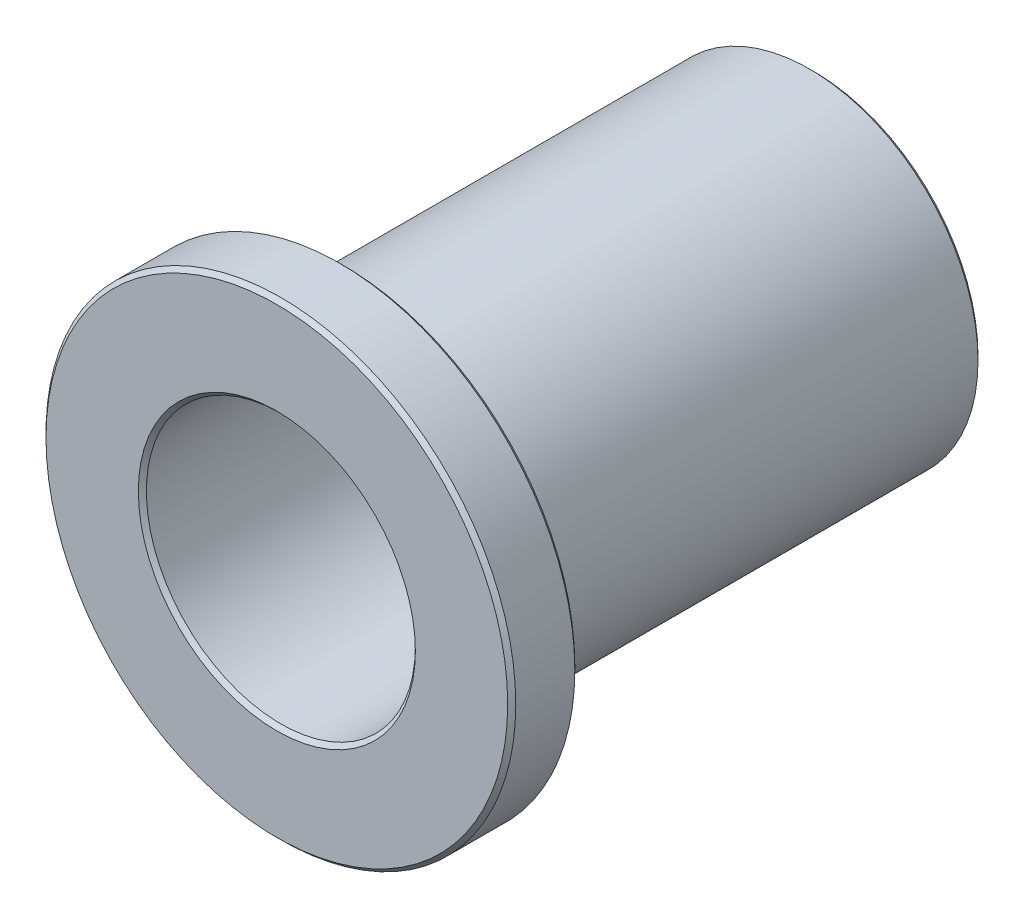
ISO-10303-21;
HEADER;
FILE_DESCRIPTION(('STEP AP214'),'2;1');
FILE_NAME('part.step','',(''),(''),'','','');
FILE_SCHEMA(('AUTOMOTIVE_DESIGN { 1 0 10303 214 1 1 1 1 }'));
ENDSEC;
DATA;
#1=APPLICATION_CONTEXT('core data for automotive mechanical design processes');
#2=APPLICATION_PROTOCOL_DEFINITION('international standard','automotive_design',2000,#1);
#3=PRODUCT_CONTEXT('',#1,'mechanical');
#4=PRODUCT('Part','Part','',(#3));
#5=PRODUCT_RELATED_PRODUCT_CATEGORY('part','',(#4));
#6=PRODUCT_DEFINITION_FORMATION('','',#4);
#7=PRODUCT_DEFINITION_CONTEXT('part definition',#1,'design');
#8=PRODUCT_DEFINITION('design','',#6,#7);
#9=PRODUCT_DEFINITION_SHAPE('','',#8);
#10=(LENGTH_UNIT() NAMED_UNIT(*) SI_UNIT(.MILLI.,.METRE.));
#11=(NAMED_UNIT(*) PLANE_ANGLE_UNIT() SI_UNIT($,.RADIAN.));
#12=(NAMED_UNIT(*) SI_UNIT($,.STERADIAN.) SOLID_ANGLE_UNIT());
#13=UNCERTAINTY_MEASURE_WITH_UNIT(LENGTH_MEASURE(1.E-05),#10,'distance_accuracy_value','');
#14=(GEOMETRIC_REPRESENTATION_CONTEXT(3) GLOBAL_UNCERTAINTY_ASSIGNED_CONTEXT((#13)) GLOBAL_UNIT_ASSIGNED_CONTEXT((#10,
#11,#12)) REPRESENTATION_CONTEXT('',''));
#15=CARTESIAN_POINT('',(0.,0.,0.));
#16=DIRECTION('',(0.,0.,1.));
#17=DIRECTION('',(1.,0.,0.));
#18=AXIS2_PLACEMENT_3D('',#15,#16,#17);
#19=CARTESIAN_POINT('',(0.,0.,9.525));
#20=DIRECTION('',(0.,0.,1.));
#21=DIRECTION('',(1.,0.,0.));
#22=AXIS2_PLACEMENT_3D('',#19,#20,#21);
#23=CYLINDRICAL_SURFACE('',#22,11.1125);
#24=CARTESIAN_POINT('',(0.,0.,12.509119));
#25=DIRECTION('',(0.,0.,1.));
#26=DIRECTION('',(1.,0.,0.));
#27=AXIS2_PLACEMENT_3D('',#24,#25,#26);
#28=CIRCLE('',#27,11.1125);
#29=CARTESIAN_POINT('',(11.1125,0.,12.509119));
#30=VERTEX_POINT('',#29);
#31=EDGE_CURVE('E69',#30,#30,#28,.F.);
#32=ORIENTED_EDGE('',*,*,#31,.T.);
#33=EDGE_LOOP('',(#32));
#34=FACE_BOUND('',#33,.T.);
#35=CARTESIAN_POINT('',(0.,0.,9.71588100000001));
#36=DIRECTION('',(0.,0.,1.));
#37=DIRECTION('',(1.,0.,0.));
#38=AXIS2_PLACEMENT_3D('',#35,#36,#37);
#39=CIRCLE('',#38,11.1125);
#40=CARTESIAN_POINT('',(11.1125,0.,9.71588100000001));
#41=VERTEX_POINT('',#40);
#42=EDGE_CURVE('E72',#41,#41,#39,.T.);
#43=ORIENTED_EDGE('',*,*,#42,.T.);
#44=EDGE_LOOP('',(#43));
#45=FACE_BOUND('',#44,.T.);
#46=ADVANCED_FACE('F41',(#34,#45),#23,.T.);
#47=CARTESIAN_POINT('',(0.,0.,9.525));
#48=DIRECTION('',(0.,0.,1.));
#49=DIRECTION('',(1.,0.,0.));
#50=AXIS2_PLACEMENT_3D('',#47,#48,#49);
#51=PLANE('',#50);
#52=CARTESIAN_POINT('',(0.,0.,9.525));
#53=DIRECTION('',(0.,0.,1.));
#54=DIRECTION('',(1.,0.,0.));
#55=AXIS2_PLACEMENT_3D('',#52,#53,#54);
#56=CIRCLE('',#55,10.921619);
#57=CARTESIAN_POINT('',(10.921619,0.,9.525));
#58=VERTEX_POINT('',#57);
#59=EDGE_CURVE('E63',#58,#58,#56,.F.);
#60=ORIENTED_EDGE('',*,*,#59,.T.);
#61=EDGE_LOOP('',(#60));
#62=FACE_BOUND('',#61,.T.);
#63=CARTESIAN_POINT('',(0.,0.,9.525));
#64=DIRECTION('',(0.,0.,1.));
#65=DIRECTION('',(1.,0.,0.));
#66=AXIS2_PLACEMENT_3D('',#63,#64,#65);
#67=CIRCLE('',#66,8.153781);
#68=CARTESIAN_POINT('',(8.153781,0.,9.525));
#69=VERTEX_POINT('',#68);
#70=EDGE_CURVE('E66',#69,#69,#67,.T.);
#71=ORIENTED_EDGE('',*,*,#70,.T.);
#72=EDGE_LOOP('',(#71));
#73=FACE_BOUND('',#72,.T.);
#74=ADVANCED_FACE('F103',(#62,#73),#51,.F.);
#75=CARTESIAN_POINT('',(0.,0.,12.7));
#76=DIRECTION('',(0.,0.,1.));
#77=DIRECTION('',(1.,0.,0.));
#78=AXIS2_PLACEMENT_3D('',#75,#76,#77);
#79=PLANE('',#78);
#80=CARTESIAN_POINT('',(0.,0.,12.7));
#81=DIRECTION('',(0.,0.,1.));
#82=DIRECTION('',(1.,0.,0.));
#83=AXIS2_PLACEMENT_3D('',#80,#81,#82);
#84=CIRCLE('',#83,6.55358100000001);
#85=CARTESIAN_POINT('',(6.55358100000001,0.,12.7));
#86=VERTEX_POINT('',#85);
#87=EDGE_CURVE('E75',#86,#86,#84,.F.);
#88=ORIENTED_EDGE('',*,*,#87,.T.);
#89=EDGE_LOOP('',(#88));
#90=FACE_BOUND('',#89,.T.);
#91=CARTESIAN_POINT('',(0.,0.,12.7));
#92=DIRECTION('',(0.,0.,1.));
#93=DIRECTION('',(1.,0.,0.));
#94=AXIS2_PLACEMENT_3D('',#91,#92,#93);
#95=CIRCLE('',#94,10.921619);
#96=CARTESIAN_POINT('',(10.921619,0.,12.7));
#97=VERTEX_POINT('',#96);
#98=EDGE_CURVE('E78',#97,#97,#95,.T.);
#99=ORIENTED_EDGE('',*,*,#98,.T.);
#100=EDGE_LOOP('',(#99));
#101=FACE_BOUND('',#100,.T.);
#102=ADVANCED_FACE('F109',(#90,#101),#79,.T.);
#103=CARTESIAN_POINT('',(0.,0.,9.525));
#104=DIRECTION('',(0.,0.,1.));
#105=DIRECTION('',(1.,0.,0.));
#106=AXIS2_PLACEMENT_3D('',#103,#104,#105);
#107=CYLINDRICAL_SURFACE('',#106,6.3627);
#108=CARTESIAN_POINT('',(0.,0.,12.509119));
#109=DIRECTION('',(0.,0.,1.));
#110=DIRECTION('',(1.,0.,0.));
#111=AXIS2_PLACEMENT_3D('',#108,#109,#110);
#112=CIRCLE('',#111,6.3627);
#113=CARTESIAN_POINT('',(6.3627,0.,12.509119));
#114=VERTEX_POINT('',#113);
#115=EDGE_CURVE('E81',#114,#114,#112,.T.);
#116=ORIENTED_EDGE('',*,*,#115,.T.);
#117=EDGE_LOOP('',(#116));
#118=FACE_BOUND('',#117,.T.);
#119=CARTESIAN_POINT('',(0.,0.,-12.509119));
#120=DIRECTION('',(0.,0.,1.));
#121=DIRECTION('',(1.,0.,0.));
#122=AXIS2_PLACEMENT_3D('',#119,#120,#121);
#123=CIRCLE('',#122,6.3627);
#124=CARTESIAN_POINT('',(6.3627,0.,-12.509119));
#125=VERTEX_POINT('',#124);
#126=EDGE_CURVE('E84',#125,#125,#123,.F.);
#127=ORIENTED_EDGE('',*,*,#126,.T.);
#128=EDGE_LOOP('',(#127));
#129=FACE_BOUND('',#128,.T.);
#130=ADVANCED_FACE('F88',(#118,#129),#107,.F.);
#131=CARTESIAN_POINT('',(0.,0.,-12.7));
#132=DIRECTION('',(0.,0.,1.));
#133=DIRECTION('',(1.,0.,0.));
#134=AXIS2_PLACEMENT_3D('',#131,#132,#133);
#135=CYLINDRICAL_SURFACE('',#134,7.9629);
#136=CARTESIAN_POINT('',(0.,0.,9.334119));
#137=DIRECTION('',(0.,0.,1.));
#138=DIRECTION('',(1.,0.,0.));
#139=AXIS2_PLACEMENT_3D('',#136,#137,#138);
#140=CIRCLE('',#139,7.9629);
#141=CARTESIAN_POINT('',(7.9629,0.,9.334119));
#142=VERTEX_POINT('',#141);
#143=EDGE_CURVE('E54',#142,#142,#140,.F.);
#144=ORIENTED_EDGE('',*,*,#143,.T.);
#145=EDGE_LOOP('',(#144));
#146=FACE_BOUND('',#145,.T.);
#147=CARTESIAN_POINT('',(0.,0.,-12.509119));
#148=DIRECTION('',(0.,0.,1.));
#149=DIRECTION('',(1.,0.,0.));
#150=AXIS2_PLACEMENT_3D('',#147,#148,#149);
#151=CIRCLE('',#150,7.9629);
#152=CARTESIAN_POINT('',(7.9629,0.,-12.509119));
#153=VERTEX_POINT('',#152);
#154=EDGE_CURVE('E58',#153,#153,#151,.T.);
#155=ORIENTED_EDGE('',*,*,#154,.T.);
#156=EDGE_LOOP('',(#155));
#157=FACE_BOUND('',#156,.T.);
#158=ADVANCED_FACE('F162',(#146,#157),#135,.T.);
#159=CARTESIAN_POINT('',(0.,0.,-12.7));
#160=DIRECTION('',(0.,0.,1.));
#161=DIRECTION('',(1.,0.,0.));
#162=AXIS2_PLACEMENT_3D('',#159,#160,#161);
#163=PLANE('',#162);
#164=CARTESIAN_POINT('',(0.,0.,-12.7));
#165=DIRECTION('',(0.,0.,1.));
#166=DIRECTION('',(1.,0.,0.));
#167=AXIS2_PLACEMENT_3D('',#164,#165,#166);
#168=CIRCLE('',#167,6.553581);
#169=CARTESIAN_POINT('',(6.553581,0.,-12.7));
#170=VERTEX_POINT('',#169);
#171=EDGE_CURVE('E10',#170,#170,#168,.T.);
#172=ORIENTED_EDGE('',*,*,#171,.T.);
#173=EDGE_LOOP('',(#172));
#174=FACE_BOUND('',#173,.T.);
#175=CARTESIAN_POINT('',(0.,0.,-12.7));
#176=DIRECTION('',(0.,0.,1.));
#177=DIRECTION('',(1.,0.,0.));
#178=AXIS2_PLACEMENT_3D('',#175,#176,#177);
#179=CIRCLE('',#178,7.772019);
#180=CARTESIAN_POINT('',(7.772019,0.,-12.7));
#181=VERTEX_POINT('',#180);
#182=EDGE_CURVE('E49',#181,#181,#179,.F.);
#183=ORIENTED_EDGE('',*,*,#182,.T.);
#184=EDGE_LOOP('',(#183));
#185=FACE_BOUND('',#184,.T.);
#186=ADVANCED_FACE('F119',(#174,#185),#163,.F.);
#187=CARTESIAN_POINT('',(0.,0.,12.509119));
#188=DIRECTION('',(0.,0.,1.));
#189=DIRECTION('',(1.,0.,0.));
#190=AXIS2_PLACEMENT_3D('',#187,#188,#189);
#191=CONICAL_SURFACE('',#190,6.3627,0.785398163397451);
#192=ORIENTED_EDGE('',*,*,#87,.F.);
#193=EDGE_LOOP('',(#192));
#194=FACE_BOUND('',#193,.T.);
#195=ORIENTED_EDGE('',*,*,#115,.F.);
#196=EDGE_LOOP('',(#195));
#197=FACE_BOUND('',#196,.T.);
#198=ADVANCED_FACE('F115',(#194,#197),#191,.F.);
#199=CARTESIAN_POINT('',(0.,0.,12.7));
#200=DIRECTION('',(0.,0.,-1.));
#201=DIRECTION('',(-1.,0.,0.));
#202=AXIS2_PLACEMENT_3D('',#199,#200,#201);
#203=CONICAL_SURFACE('',#202,10.921619,0.785398163397448);
#204=ORIENTED_EDGE('',*,*,#31,.F.);
#205=EDGE_LOOP('',(#204));
#206=FACE_BOUND('',#205,.T.);
#207=ORIENTED_EDGE('',*,*,#98,.F.);
#208=EDGE_LOOP('',(#207));
#209=FACE_BOUND('',#208,.T.);
#210=ADVANCED_FACE('F118',(#206,#209),#203,.T.);
#211=CARTESIAN_POINT('',(0.,0.,9.71588100000001));
#212=DIRECTION('',(0.,0.,1.));
#213=DIRECTION('',(1.,0.,0.));
#214=AXIS2_PLACEMENT_3D('',#211,#212,#213);
#215=CONICAL_SURFACE('',#214,11.1125,0.785398163397439);
#216=ORIENTED_EDGE('',*,*,#59,.F.);
#217=EDGE_LOOP('',(#216));
#218=FACE_BOUND('',#217,.T.);
#219=ORIENTED_EDGE('',*,*,#42,.F.);
#220=EDGE_LOOP('',(#219));
#221=FACE_BOUND('',#220,.T.);
#222=ADVANCED_FACE('F99',(#218,#221),#215,.T.);
#223=CARTESIAN_POINT('',(0.,0.,9.525));
#224=DIRECTION('',(0.,0.,1.));
#225=DIRECTION('',(1.,0.,0.));
#226=AXIS2_PLACEMENT_3D('',#223,#224,#225);
#227=CONICAL_SURFACE('',#226,8.153781,0.785398163397453);
#228=ORIENTED_EDGE('',*,*,#143,.F.);
#229=EDGE_LOOP('',(#228));
#230=FACE_BOUND('',#229,.T.);
#231=ORIENTED_EDGE('',*,*,#70,.F.);
#232=EDGE_LOOP('',(#231));
#233=FACE_BOUND('',#232,.T.);
#234=ADVANCED_FACE('F93',(#230,#233),#227,.T.);
#235=CARTESIAN_POINT('',(0.,0.,-12.7));
#236=DIRECTION('',(0.,0.,-1.));
#237=DIRECTION('',(-1.,0.,0.));
#238=AXIS2_PLACEMENT_3D('',#235,#236,#237);
#239=CONICAL_SURFACE('',#238,6.553581,0.785398163397455);
#240=ORIENTED_EDGE('',*,*,#126,.F.);
#241=EDGE_LOOP('',(#240));
#242=FACE_BOUND('',#241,.T.);
#243=ORIENTED_EDGE('',*,*,#171,.F.);
#244=EDGE_LOOP('',(#243));
#245=FACE_BOUND('',#244,.T.);
#246=ADVANCED_FACE('F90',(#242,#245),#239,.F.);
#247=CARTESIAN_POINT('',(0.,0.,-12.509119));
#248=DIRECTION('',(0.,0.,1.));
#249=DIRECTION('',(1.,0.,0.));
#250=AXIS2_PLACEMENT_3D('',#247,#248,#249);
#251=CONICAL_SURFACE('',#250,7.9629,0.785398163397457);
#252=ORIENTED_EDGE('',*,*,#182,.F.);
#253=EDGE_LOOP('',(#252));
#254=FACE_BOUND('',#253,.T.);
#255=ORIENTED_EDGE('',*,*,#154,.F.);
#256=EDGE_LOOP('',(#255));
#257=FACE_BOUND('',#256,.T.);
#258=ADVANCED_FACE('F43',(#254,#257),#251,.T.);
#259=CLOSED_SHELL('',(#46,#74,#102,#130,#158,#186,#198,#210,#222,#234,#246,#258));
#260=MANIFOLD_SOLID_BREP('B2',#259);
#261=ADVANCED_BREP_SHAPE_REPRESENTATION('',(#18,#260),#14);
#262=SHAPE_DEFINITION_REPRESENTATION(#9,#261);
ENDSEC;
END-ISO-10303-21;
